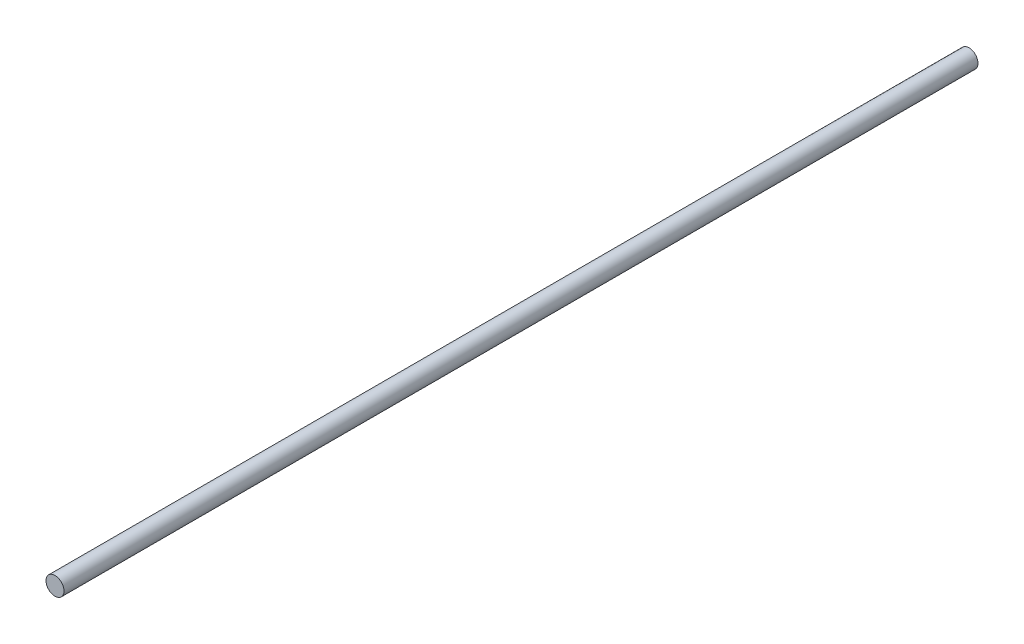
ISO-10303-21;
HEADER;
FILE_DESCRIPTION(('STEP AP214'),'2;1');
FILE_NAME('part.step','',(''),(''),'','','');
FILE_SCHEMA(('AUTOMOTIVE_DESIGN { 1 0 10303 214 1 1 1 1 }'));
ENDSEC;
DATA;
#1=APPLICATION_CONTEXT('core data for automotive mechanical design processes');
#2=APPLICATION_PROTOCOL_DEFINITION('international standard','automotive_design',2000,#1);
#3=PRODUCT_CONTEXT('',#1,'mechanical');
#4=PRODUCT('Part','Part','',(#3));
#5=PRODUCT_RELATED_PRODUCT_CATEGORY('part','',(#4));
#6=PRODUCT_DEFINITION_FORMATION('','',#4);
#7=PRODUCT_DEFINITION_CONTEXT('part definition',#1,'design');
#8=PRODUCT_DEFINITION('design','',#6,#7);
#9=PRODUCT_DEFINITION_SHAPE('','',#8);
#10=(LENGTH_UNIT() NAMED_UNIT(*) SI_UNIT(.MILLI.,.METRE.));
#11=(NAMED_UNIT(*) PLANE_ANGLE_UNIT() SI_UNIT($,.RADIAN.));
#12=(NAMED_UNIT(*) SI_UNIT($,.STERADIAN.) SOLID_ANGLE_UNIT());
#13=UNCERTAINTY_MEASURE_WITH_UNIT(LENGTH_MEASURE(1.E-05),#10,'distance_accuracy_value','');
#14=(GEOMETRIC_REPRESENTATION_CONTEXT(3) GLOBAL_UNCERTAINTY_ASSIGNED_CONTEXT((#13)) GLOBAL_UNIT_ASSIGNED_CONTEXT((#10,
#11,#12)) REPRESENTATION_CONTEXT('',''));
#15=CARTESIAN_POINT('',(0.,0.,0.));
#16=DIRECTION('',(0.,0.,1.));
#17=DIRECTION('',(1.,0.,0.));
#18=AXIS2_PLACEMENT_3D('',#15,#16,#17);
#19=CARTESIAN_POINT('',(0.,0.,609.));
#20=DIRECTION('',(0.,0.,-1.));
#21=DIRECTION('',(-1.,0.,0.));
#22=AXIS2_PLACEMENT_3D('',#19,#20,#21);
#23=CYLINDRICAL_SURFACE('',#22,6.);
#24=CARTESIAN_POINT('',(0.,0.,609.));
#25=DIRECTION('',(0.,0.,1.));
#26=DIRECTION('',(1.,0.,0.));
#27=AXIS2_PLACEMENT_3D('',#24,#25,#26);
#28=CIRCLE('',#27,6.);
#29=CARTESIAN_POINT('',(6.,0.,609.));
#30=VERTEX_POINT('',#29);
#31=EDGE_CURVE('E10',#30,#30,#28,.T.);
#32=ORIENTED_EDGE('',*,*,#31,.F.);
#33=EDGE_LOOP('',(#32));
#34=FACE_BOUND('',#33,.T.);
#35=CARTESIAN_POINT('',(0.,0.,0.));
#36=DIRECTION('',(0.,0.,1.));
#37=DIRECTION('',(1.,0.,0.));
#38=AXIS2_PLACEMENT_3D('',#35,#36,#37);
#39=CIRCLE('',#38,6.);
#40=CARTESIAN_POINT('',(6.,0.,0.));
#41=VERTEX_POINT('',#40);
#42=EDGE_CURVE('E34',#41,#41,#39,.T.);
#43=ORIENTED_EDGE('',*,*,#42,.T.);
#44=EDGE_LOOP('',(#43));
#45=FACE_BOUND('',#44,.T.);
#46=ADVANCED_FACE('F31',(#34,#45),#23,.T.);
#47=CARTESIAN_POINT('',(0.,0.,609.));
#48=DIRECTION('',(0.,0.,1.));
#49=DIRECTION('',(1.,0.,0.));
#50=AXIS2_PLACEMENT_3D('',#47,#48,#49);
#51=PLANE('',#50);
#52=ORIENTED_EDGE('',*,*,#31,.T.);
#53=EDGE_LOOP('',(#52));
#54=FACE_BOUND('',#53,.T.);
#55=ADVANCED_FACE('F46',(#54),#51,.T.);
#56=CARTESIAN_POINT('',(0.,0.,0.));
#57=DIRECTION('',(0.,0.,1.));
#58=DIRECTION('',(1.,0.,0.));
#59=AXIS2_PLACEMENT_3D('',#56,#57,#58);
#60=PLANE('',#59);
#61=ORIENTED_EDGE('',*,*,#42,.F.);
#62=EDGE_LOOP('',(#61));
#63=FACE_BOUND('',#62,.T.);
#64=ADVANCED_FACE('F44',(#63),#60,.F.);
#65=CLOSED_SHELL('',(#46,#55,#64));
#66=MANIFOLD_SOLID_BREP('B2',#65);
#67=ADVANCED_BREP_SHAPE_REPRESENTATION('',(#18,#66),#14);
#68=SHAPE_DEFINITION_REPRESENTATION(#9,#67);
ENDSEC;
END-ISO-10303-21;
